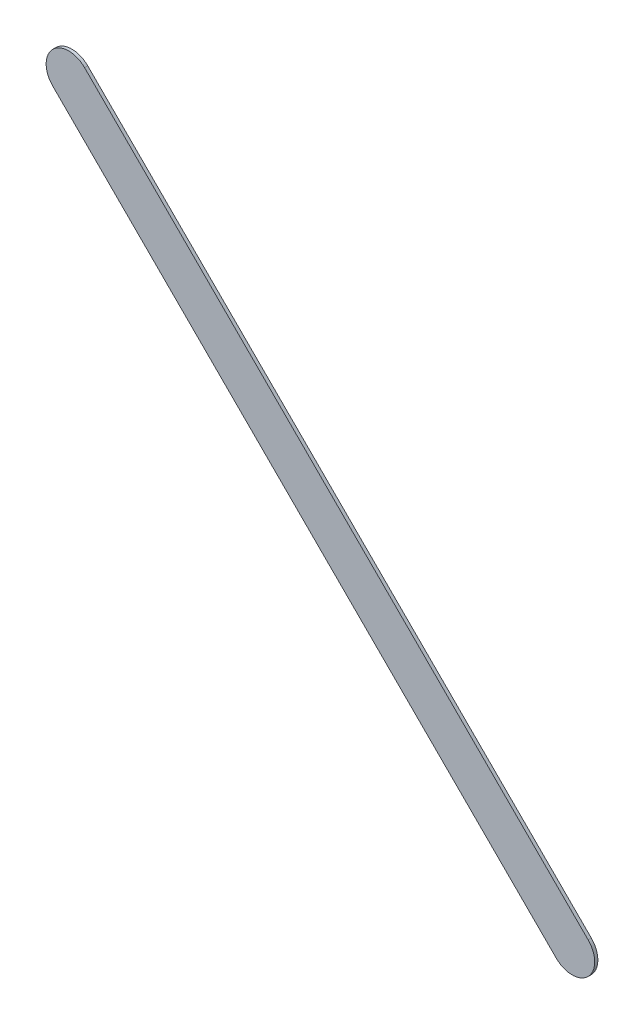
ISO-10303-21;
HEADER;
FILE_DESCRIPTION(('STEP AP214'),'2;1');
FILE_NAME('part.step','',(''),(''),'','','');
FILE_SCHEMA(('AUTOMOTIVE_DESIGN { 1 0 10303 214 1 1 1 1 }'));
ENDSEC;
DATA;
#1=APPLICATION_CONTEXT('core data for automotive mechanical design processes');
#2=APPLICATION_PROTOCOL_DEFINITION('international standard','automotive_design',2000,#1);
#3=PRODUCT_CONTEXT('',#1,'mechanical');
#4=PRODUCT('Part','Part','',(#3));
#5=PRODUCT_RELATED_PRODUCT_CATEGORY('part','',(#4));
#6=PRODUCT_DEFINITION_FORMATION('','',#4);
#7=PRODUCT_DEFINITION_CONTEXT('part definition',#1,'design');
#8=PRODUCT_DEFINITION('design','',#6,#7);
#9=PRODUCT_DEFINITION_SHAPE('','',#8);
#10=(LENGTH_UNIT() NAMED_UNIT(*) SI_UNIT(.MILLI.,.METRE.));
#11=(NAMED_UNIT(*) PLANE_ANGLE_UNIT() SI_UNIT($,.RADIAN.));
#12=(NAMED_UNIT(*) SI_UNIT($,.STERADIAN.) SOLID_ANGLE_UNIT());
#13=UNCERTAINTY_MEASURE_WITH_UNIT(LENGTH_MEASURE(1.E-05),#10,'distance_accuracy_value','');
#14=(GEOMETRIC_REPRESENTATION_CONTEXT(3) GLOBAL_UNCERTAINTY_ASSIGNED_CONTEXT((#13)) GLOBAL_UNIT_ASSIGNED_CONTEXT((#10,
#11,#12)) REPRESENTATION_CONTEXT('',''));
#15=CARTESIAN_POINT('',(0.,0.,0.));
#16=DIRECTION('',(0.,0.,1.));
#17=DIRECTION('',(1.,0.,0.));
#18=AXIS2_PLACEMENT_3D('',#15,#16,#17);
#19=CARTESIAN_POINT('',(154.763223,-82.980776,0.));
#20=DIRECTION('',(0.,0.,1.));
#21=DIRECTION('',(1.,0.,0.));
#22=AXIS2_PLACEMENT_3D('',#19,#20,#21);
#23=PLANE('',#22);
#24=DIRECTION('',(0.707106781186548,-0.707106781186548,0.));
#25=VECTOR('',#24,1.);
#26=CARTESIAN_POINT('',(154.763223,-82.980776,0.));
#27=LINE('',#26,#25);
#28=CARTESIAN_POINT('',(154.763223,-82.980776,0.));
#29=VERTEX_POINT('',#28);
#30=CARTESIAN_POINT('',(160.351223,-88.568776,0.));
#31=VERTEX_POINT('',#30);
#32=EDGE_CURVE('E82',#29,#31,#27,.T.);
#33=ORIENTED_EDGE('',*,*,#32,.T.);
#34=CARTESIAN_POINT('',(160.5279995,-88.3919995,0.));
#35=DIRECTION('',(0.,0.,1.));
#36=DIRECTION('',(-0.707106781186548,-0.707106781186548,0.));
#37=AXIS2_PLACEMENT_3D('',#34,#35,#36);
#38=CIRCLE('',#37,0.249999723809);
#39=CARTESIAN_POINT('',(160.704776,-88.215223,0.));
#40=VERTEX_POINT('',#39);
#41=EDGE_CURVE('E109',#31,#40,#38,.T.);
#42=ORIENTED_EDGE('',*,*,#41,.T.);
#43=DIRECTION('',(-0.707106781186548,0.707106781186548,0.));
#44=VECTOR('',#43,1.);
#45=CARTESIAN_POINT('',(160.704776,-88.215223,0.));
#46=LINE('',#45,#44);
#47=CARTESIAN_POINT('',(155.116776,-82.627223,0.));
#48=VERTEX_POINT('',#47);
#49=EDGE_CURVE('E74',#40,#48,#46,.T.);
#50=ORIENTED_EDGE('',*,*,#49,.T.);
#51=CARTESIAN_POINT('',(154.9399995,-82.8039995,0.));
#52=DIRECTION('',(0.,0.,1.));
#53=DIRECTION('',(0.707106781186548,0.707106781186548,0.));
#54=AXIS2_PLACEMENT_3D('',#51,#52,#53);
#55=CIRCLE('',#54,0.249999723809);
#56=EDGE_CURVE('E11',#48,#29,#55,.T.);
#57=ORIENTED_EDGE('',*,*,#56,.T.);
#58=EDGE_LOOP('',(#33,#42,#50,#57));
#59=FACE_BOUND('',#58,.T.);
#60=ADVANCED_FACE('F17',(#59),#23,.T.);
#61=CARTESIAN_POINT('',(154.763223,-82.980776,-0.035));
#62=DIRECTION('',(0.,0.,1.));
#63=DIRECTION('',(1.,0.,0.));
#64=AXIS2_PLACEMENT_3D('',#61,#62,#63);
#65=PLANE('',#64);
#66=CARTESIAN_POINT('',(154.9399995,-82.8039995,-0.035));
#67=DIRECTION('',(0.,0.,1.));
#68=DIRECTION('',(0.707106781186548,0.707106781186548,0.));
#69=AXIS2_PLACEMENT_3D('',#66,#67,#68);
#70=CIRCLE('',#69,0.249999723809);
#71=CARTESIAN_POINT('',(155.116776,-82.627223,-0.035));
#72=VERTEX_POINT('',#71);
#73=CARTESIAN_POINT('',(154.763223,-82.980776,-0.035));
#74=VERTEX_POINT('',#73);
#75=EDGE_CURVE('E25',#72,#74,#70,.T.);
#76=ORIENTED_EDGE('',*,*,#75,.F.);
#77=DIRECTION('',(-0.707106781186548,0.707106781186548,0.));
#78=VECTOR('',#77,1.);
#79=CARTESIAN_POINT('',(160.704776,-88.215223,-0.035));
#80=LINE('',#79,#78);
#81=CARTESIAN_POINT('',(160.704776,-88.215223,-0.035));
#82=VERTEX_POINT('',#81);
#83=EDGE_CURVE('E105',#82,#72,#80,.T.);
#84=ORIENTED_EDGE('',*,*,#83,.F.);
#85=CARTESIAN_POINT('',(160.5279995,-88.3919995,-0.035));
#86=DIRECTION('',(0.,0.,1.));
#87=DIRECTION('',(-0.707106781186548,-0.707106781186548,0.));
#88=AXIS2_PLACEMENT_3D('',#85,#86,#87);
#89=CIRCLE('',#88,0.249999723809);
#90=CARTESIAN_POINT('',(160.351223,-88.568776,-0.035));
#91=VERTEX_POINT('',#90);
#92=EDGE_CURVE('E84',#91,#82,#89,.T.);
#93=ORIENTED_EDGE('',*,*,#92,.F.);
#94=DIRECTION('',(0.707106781186548,-0.707106781186548,0.));
#95=VECTOR('',#94,1.);
#96=CARTESIAN_POINT('',(154.763223,-82.980776,-0.035));
#97=LINE('',#96,#95);
#98=EDGE_CURVE('E80',#74,#91,#97,.T.);
#99=ORIENTED_EDGE('',*,*,#98,.F.);
#100=EDGE_LOOP('',(#76,#84,#93,#99));
#101=FACE_BOUND('',#100,.T.);
#102=ADVANCED_FACE('F86',(#101),#65,.F.);
#103=CARTESIAN_POINT('',(154.9399995,-82.8039995,-0.035));
#104=DIRECTION('',(0.,0.,-1.));
#105=DIRECTION('',(0.707106781186548,0.707106781186548,0.));
#106=AXIS2_PLACEMENT_3D('',#103,#104,#105);
#107=CYLINDRICAL_SURFACE('',#106,0.249999723809);
#108=ORIENTED_EDGE('',*,*,#75,.T.);
#109=DIRECTION('',(0.,0.,1.));
#110=VECTOR('',#109,1.);
#111=CARTESIAN_POINT('',(154.763223,-82.980776,-0.035));
#112=LINE('',#111,#110);
#113=EDGE_CURVE('E68',#74,#29,#112,.T.);
#114=ORIENTED_EDGE('',*,*,#113,.T.);
#115=ORIENTED_EDGE('',*,*,#56,.F.);
#116=DIRECTION('',(0.,0.,1.));
#117=VECTOR('',#116,1.);
#118=CARTESIAN_POINT('',(155.116776,-82.627223,-0.035));
#119=LINE('',#118,#117);
#120=EDGE_CURVE('E71',#72,#48,#119,.T.);
#121=ORIENTED_EDGE('',*,*,#120,.F.);
#122=EDGE_LOOP('',(#108,#114,#115,#121));
#123=FACE_BOUND('',#122,.T.);
#124=ADVANCED_FACE('F67',(#123),#107,.T.);
#125=CARTESIAN_POINT('',(160.704776,-88.215223,-0.035));
#126=DIRECTION('',(-0.707106781186548,-0.707106781186548,0.));
#127=DIRECTION('',(-0.707106781186548,0.707106781186548,0.));
#128=AXIS2_PLACEMENT_3D('',#125,#126,#127);
#129=PLANE('',#128);
#130=ORIENTED_EDGE('',*,*,#83,.T.);
#131=ORIENTED_EDGE('',*,*,#120,.T.);
#132=ORIENTED_EDGE('',*,*,#49,.F.);
#133=DIRECTION('',(0.,0.,1.));
#134=VECTOR('',#133,1.);
#135=CARTESIAN_POINT('',(160.704776,-88.215223,-0.035));
#136=LINE('',#135,#134);
#137=EDGE_CURVE('E102',#82,#40,#136,.T.);
#138=ORIENTED_EDGE('',*,*,#137,.F.);
#139=EDGE_LOOP('',(#130,#131,#132,#138));
#140=FACE_BOUND('',#139,.T.);
#141=ADVANCED_FACE('F120',(#140),#129,.F.);
#142=CARTESIAN_POINT('',(160.5279995,-88.3919995,-0.035));
#143=DIRECTION('',(0.,0.,-1.));
#144=DIRECTION('',(-0.707106781186548,-0.707106781186548,0.));
#145=AXIS2_PLACEMENT_3D('',#142,#143,#144);
#146=CYLINDRICAL_SURFACE('',#145,0.249999723809);
#147=ORIENTED_EDGE('',*,*,#92,.T.);
#148=ORIENTED_EDGE('',*,*,#137,.T.);
#149=ORIENTED_EDGE('',*,*,#41,.F.);
#150=DIRECTION('',(0.,0.,1.));
#151=VECTOR('',#150,1.);
#152=CARTESIAN_POINT('',(160.351223,-88.568776,-0.035));
#153=LINE('',#152,#151);
#154=EDGE_CURVE('E90',#91,#31,#153,.T.);
#155=ORIENTED_EDGE('',*,*,#154,.F.);
#156=EDGE_LOOP('',(#147,#148,#149,#155));
#157=FACE_BOUND('',#156,.T.);
#158=ADVANCED_FACE('F122',(#157),#146,.T.);
#159=CARTESIAN_POINT('',(154.763223,-82.980776,-0.035));
#160=DIRECTION('',(0.707106781186548,0.707106781186548,0.));
#161=DIRECTION('',(0.,0.,-1.));
#162=AXIS2_PLACEMENT_3D('',#159,#160,#161);
#163=PLANE('',#162);
#164=ORIENTED_EDGE('',*,*,#98,.T.);
#165=ORIENTED_EDGE('',*,*,#154,.T.);
#166=ORIENTED_EDGE('',*,*,#32,.F.);
#167=ORIENTED_EDGE('',*,*,#113,.F.);
#168=EDGE_LOOP('',(#164,#165,#166,#167));
#169=FACE_BOUND('',#168,.T.);
#170=ADVANCED_FACE('F78',(#169),#163,.F.);
#171=CLOSED_SHELL('',(#60,#102,#124,#141,#158,#170));
#172=MANIFOLD_SOLID_BREP('B1',#171);
#173=ADVANCED_BREP_SHAPE_REPRESENTATION('',(#18,#172),#14);
#174=SHAPE_DEFINITION_REPRESENTATION(#9,#173);
ENDSEC;
END-ISO-10303-21;
